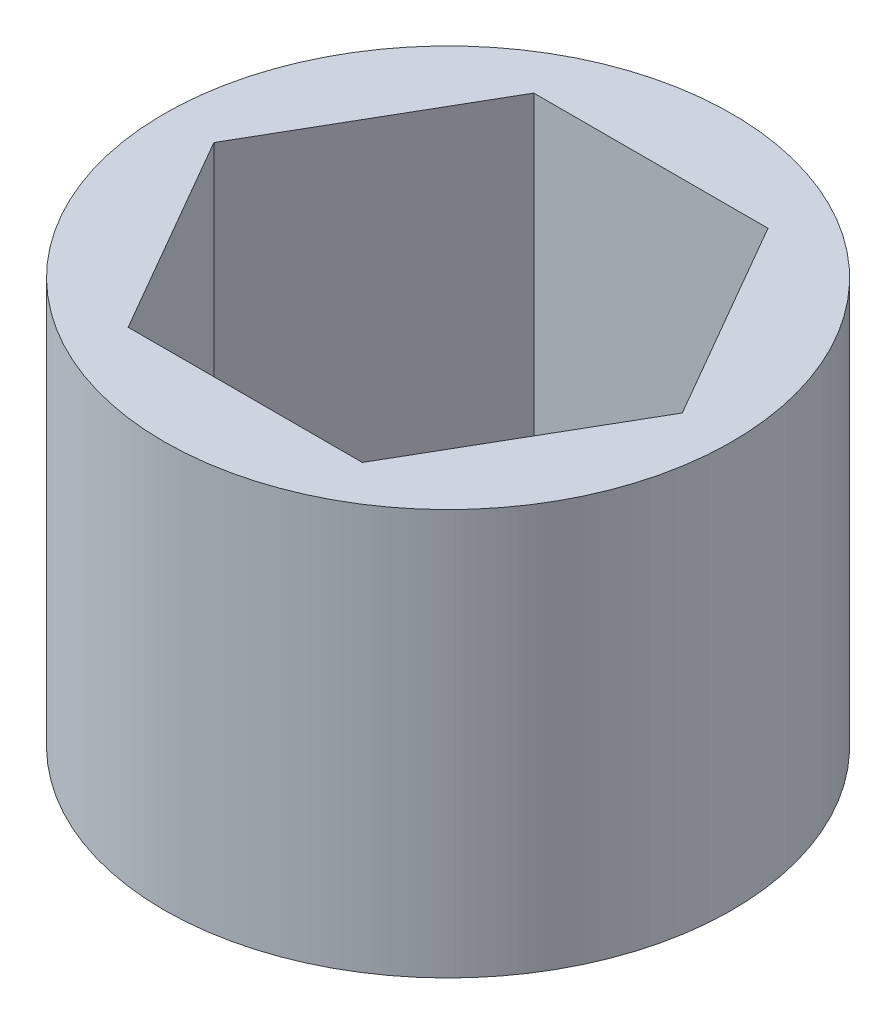
ISO-10303-21;
HEADER;
FILE_DESCRIPTION(('STEP AP214'),'2;1');
FILE_NAME('part.step','',(''),(''),'','','');
FILE_SCHEMA(('AUTOMOTIVE_DESIGN { 1 0 10303 214 1 1 1 1 }'));
ENDSEC;
DATA;
#1=APPLICATION_CONTEXT('core data for automotive mechanical design processes');
#2=APPLICATION_PROTOCOL_DEFINITION('international standard','automotive_design',2000,#1);
#3=PRODUCT_CONTEXT('',#1,'mechanical');
#4=PRODUCT('Part','Part','',(#3));
#5=PRODUCT_RELATED_PRODUCT_CATEGORY('part','',(#4));
#6=PRODUCT_DEFINITION_FORMATION('','',#4);
#7=PRODUCT_DEFINITION_CONTEXT('part definition',#1,'design');
#8=PRODUCT_DEFINITION('design','',#6,#7);
#9=PRODUCT_DEFINITION_SHAPE('','',#8);
#10=(LENGTH_UNIT() NAMED_UNIT(*) SI_UNIT(.MILLI.,.METRE.));
#11=(NAMED_UNIT(*) PLANE_ANGLE_UNIT() SI_UNIT($,.RADIAN.));
#12=(NAMED_UNIT(*) SI_UNIT($,.STERADIAN.) SOLID_ANGLE_UNIT());
#13=UNCERTAINTY_MEASURE_WITH_UNIT(LENGTH_MEASURE(1.E-05),#10,'distance_accuracy_value','');
#14=(GEOMETRIC_REPRESENTATION_CONTEXT(3) GLOBAL_UNCERTAINTY_ASSIGNED_CONTEXT((#13)) GLOBAL_UNIT_ASSIGNED_CONTEXT((#10,
#11,#12)) REPRESENTATION_CONTEXT('',''));
#15=CARTESIAN_POINT('',(0.,0.,0.));
#16=DIRECTION('',(0.,0.,1.));
#17=DIRECTION('',(1.,0.,0.));
#18=AXIS2_PLACEMENT_3D('',#15,#16,#17);
#19=CARTESIAN_POINT('',(0.,12.7,0.));
#20=DIRECTION('',(0.,1.,0.));
#21=DIRECTION('',(0.,0.,1.));
#22=AXIS2_PLACEMENT_3D('',#19,#20,#21);
#23=PLANE('',#22);
#24=CARTESIAN_POINT('',(0.,12.7,0.));
#25=DIRECTION('',(0.,1.,0.));
#26=DIRECTION('',(0.,0.,1.));
#27=AXIS2_PLACEMENT_3D('',#24,#25,#26);
#28=CIRCLE('',#27,8.89);
#29=CARTESIAN_POINT('',(0.,12.7,8.89));
#30=VERTEX_POINT('',#29);
#31=EDGE_CURVE('E11',#30,#30,#28,.T.);
#32=ORIENTED_EDGE('',*,*,#31,.T.);
#33=EDGE_LOOP('',(#32));
#34=FACE_BOUND('',#33,.T.);
#35=DIRECTION('',(-0.5,0.,-0.866025403784439));
#36=VECTOR('',#35,1.);
#37=CARTESIAN_POINT('',(7.33234841870825,12.7,0.));
#38=LINE('',#37,#36);
#39=CARTESIAN_POINT('',(7.33234841870825,12.7,0.));
#40=VERTEX_POINT('',#39);
#41=CARTESIAN_POINT('',(3.66617420935412,12.7,-6.35000000000001));
#42=VERTEX_POINT('',#41);
#43=EDGE_CURVE('E108',#40,#42,#38,.T.);
#44=ORIENTED_EDGE('',*,*,#43,.F.);
#45=DIRECTION('',(0.5,0.,-0.866025403784439));
#46=VECTOR('',#45,1.);
#47=CARTESIAN_POINT('',(3.66617420935413,12.7,6.35));
#48=LINE('',#47,#46);
#49=CARTESIAN_POINT('',(3.66617420935413,12.7,6.35));
#50=VERTEX_POINT('',#49);
#51=EDGE_CURVE('E99',#50,#40,#48,.T.);
#52=ORIENTED_EDGE('',*,*,#51,.F.);
#53=DIRECTION('',(1.,0.,0.));
#54=VECTOR('',#53,1.);
#55=CARTESIAN_POINT('',(-3.66617420935413,12.7,6.35));
#56=LINE('',#55,#54);
#57=CARTESIAN_POINT('',(-3.66617420935413,12.7,6.35));
#58=VERTEX_POINT('',#57);
#59=EDGE_CURVE('E133',#58,#50,#56,.T.);
#60=ORIENTED_EDGE('',*,*,#59,.F.);
#61=DIRECTION('',(0.5,0.,0.866025403784439));
#62=VECTOR('',#61,1.);
#63=CARTESIAN_POINT('',(-7.33234841870825,12.7,0.));
#64=LINE('',#63,#62);
#65=CARTESIAN_POINT('',(-7.33234841870825,12.7,0.));
#66=VERTEX_POINT('',#65);
#67=EDGE_CURVE('E130',#66,#58,#64,.T.);
#68=ORIENTED_EDGE('',*,*,#67,.F.);
#69=DIRECTION('',(-0.5,0.,0.866025403784439));
#70=VECTOR('',#69,1.);
#71=CARTESIAN_POINT('',(-3.66617420935413,12.7,-6.35000000000001));
#72=LINE('',#71,#70);
#73=CARTESIAN_POINT('',(-3.66617420935413,12.7,-6.35000000000001));
#74=VERTEX_POINT('',#73);
#75=EDGE_CURVE('E125',#74,#66,#72,.T.);
#76=ORIENTED_EDGE('',*,*,#75,.F.);
#77=DIRECTION('',(-1.,0.,0.));
#78=VECTOR('',#77,1.);
#79=CARTESIAN_POINT('',(3.66617420935412,12.7,-6.35000000000001));
#80=LINE('',#79,#78);
#81=EDGE_CURVE('E121',#42,#74,#80,.T.);
#82=ORIENTED_EDGE('',*,*,#81,.F.);
#83=EDGE_LOOP('',(#44,#52,#60,#68,#76,#82));
#84=FACE_BOUND('',#83,.T.);
#85=ADVANCED_FACE('F45',(#34,#84),#23,.T.);
#86=CARTESIAN_POINT('',(0.,0.,0.));
#87=DIRECTION('',(0.,1.,0.));
#88=DIRECTION('',(0.,0.,1.));
#89=AXIS2_PLACEMENT_3D('',#86,#87,#88);
#90=PLANE('',#89);
#91=CARTESIAN_POINT('',(0.,0.,0.));
#92=DIRECTION('',(0.,1.,0.));
#93=DIRECTION('',(0.,0.,1.));
#94=AXIS2_PLACEMENT_3D('',#91,#92,#93);
#95=CIRCLE('',#94,8.89);
#96=CARTESIAN_POINT('',(0.,0.,8.89));
#97=VERTEX_POINT('',#96);
#98=EDGE_CURVE('E49',#97,#97,#95,.T.);
#99=ORIENTED_EDGE('',*,*,#98,.F.);
#100=EDGE_LOOP('',(#99));
#101=FACE_BOUND('',#100,.T.);
#102=DIRECTION('',(0.5,0.,-0.866025403784439));
#103=VECTOR('',#102,1.);
#104=CARTESIAN_POINT('',(3.66617420935413,0.,6.35));
#105=LINE('',#104,#103);
#106=CARTESIAN_POINT('',(3.66617420935413,0.,6.35));
#107=VERTEX_POINT('',#106);
#108=CARTESIAN_POINT('',(7.33234841870825,0.,0.));
#109=VERTEX_POINT('',#108);
#110=EDGE_CURVE('E69',#107,#109,#105,.T.);
#111=ORIENTED_EDGE('',*,*,#110,.T.);
#112=DIRECTION('',(-0.5,0.,-0.866025403784439));
#113=VECTOR('',#112,1.);
#114=CARTESIAN_POINT('',(7.33234841870825,0.,0.));
#115=LINE('',#114,#113);
#116=CARTESIAN_POINT('',(3.66617420935412,0.,-6.35000000000001));
#117=VERTEX_POINT('',#116);
#118=EDGE_CURVE('E115',#109,#117,#115,.T.);
#119=ORIENTED_EDGE('',*,*,#118,.T.);
#120=DIRECTION('',(-1.,0.,0.));
#121=VECTOR('',#120,1.);
#122=CARTESIAN_POINT('',(3.66617420935412,0.,-6.35000000000001));
#123=LINE('',#122,#121);
#124=CARTESIAN_POINT('',(-3.66617420935413,0.,-6.35000000000001));
#125=VERTEX_POINT('',#124);
#126=EDGE_CURVE('E140',#117,#125,#123,.T.);
#127=ORIENTED_EDGE('',*,*,#126,.T.);
#128=DIRECTION('',(-0.5,0.,0.866025403784439));
#129=VECTOR('',#128,1.);
#130=CARTESIAN_POINT('',(-3.66617420935413,0.,-6.35000000000001));
#131=LINE('',#130,#129);
#132=CARTESIAN_POINT('',(-7.33234841870825,0.,0.));
#133=VERTEX_POINT('',#132);
#134=EDGE_CURVE('E144',#125,#133,#131,.T.);
#135=ORIENTED_EDGE('',*,*,#134,.T.);
#136=DIRECTION('',(0.5,0.,0.866025403784439));
#137=VECTOR('',#136,1.);
#138=CARTESIAN_POINT('',(-7.33234841870825,0.,0.));
#139=LINE('',#138,#137);
#140=CARTESIAN_POINT('',(-3.66617420935413,0.,6.35));
#141=VERTEX_POINT('',#140);
#142=EDGE_CURVE('E148',#133,#141,#139,.T.);
#143=ORIENTED_EDGE('',*,*,#142,.T.);
#144=DIRECTION('',(1.,0.,0.));
#145=VECTOR('',#144,1.);
#146=CARTESIAN_POINT('',(-3.66617420935413,0.,6.35));
#147=LINE('',#146,#145);
#148=EDGE_CURVE('E109',#141,#107,#147,.T.);
#149=ORIENTED_EDGE('',*,*,#148,.T.);
#150=EDGE_LOOP('',(#111,#119,#127,#135,#143,#149));
#151=FACE_BOUND('',#150,.T.);
#152=ADVANCED_FACE('F172',(#101,#151),#90,.F.);
#153=CARTESIAN_POINT('',(0.,12.7,0.));
#154=DIRECTION('',(0.,-1.,0.));
#155=DIRECTION('',(0.,0.,-1.));
#156=AXIS2_PLACEMENT_3D('',#153,#154,#155);
#157=CYLINDRICAL_SURFACE('',#156,8.89);
#158=ORIENTED_EDGE('',*,*,#31,.F.);
#159=EDGE_LOOP('',(#158));
#160=FACE_BOUND('',#159,.T.);
#161=ORIENTED_EDGE('',*,*,#98,.T.);
#162=EDGE_LOOP('',(#161));
#163=FACE_BOUND('',#162,.T.);
#164=ADVANCED_FACE('F47',(#160,#163),#157,.T.);
#165=CARTESIAN_POINT('',(3.66617420935413,12.7,6.35));
#166=DIRECTION('',(-0.866025403784439,0.,-0.5));
#167=DIRECTION('',(-0.5,0.,0.866025403784439));
#168=AXIS2_PLACEMENT_3D('',#165,#166,#167);
#169=PLANE('',#168);
#170=ORIENTED_EDGE('',*,*,#110,.F.);
#171=DIRECTION('',(0.,-1.,0.));
#172=VECTOR('',#171,1.);
#173=CARTESIAN_POINT('',(3.66617420935413,12.7,6.35));
#174=LINE('',#173,#172);
#175=EDGE_CURVE('E103',#50,#107,#174,.T.);
#176=ORIENTED_EDGE('',*,*,#175,.F.);
#177=ORIENTED_EDGE('',*,*,#51,.T.);
#178=DIRECTION('',(0.,-1.,0.));
#179=VECTOR('',#178,1.);
#180=CARTESIAN_POINT('',(7.33234841870825,12.7,0.));
#181=LINE('',#180,#179);
#182=EDGE_CURVE('E102',#40,#109,#181,.T.);
#183=ORIENTED_EDGE('',*,*,#182,.T.);
#184=EDGE_LOOP('',(#170,#176,#177,#183));
#185=FACE_BOUND('',#184,.T.);
#186=ADVANCED_FACE('F101',(#185),#169,.T.);
#187=CARTESIAN_POINT('',(7.33234841870825,12.7,0.));
#188=DIRECTION('',(-0.866025403784439,0.,0.5));
#189=DIRECTION('',(0.5,0.,0.866025403784439));
#190=AXIS2_PLACEMENT_3D('',#187,#188,#189);
#191=PLANE('',#190);
#192=ORIENTED_EDGE('',*,*,#118,.F.);
#193=ORIENTED_EDGE('',*,*,#182,.F.);
#194=ORIENTED_EDGE('',*,*,#43,.T.);
#195=DIRECTION('',(0.,-1.,0.));
#196=VECTOR('',#195,1.);
#197=CARTESIAN_POINT('',(3.66617420935412,12.7,-6.35000000000001));
#198=LINE('',#197,#196);
#199=EDGE_CURVE('E117',#42,#117,#198,.T.);
#200=ORIENTED_EDGE('',*,*,#199,.T.);
#201=EDGE_LOOP('',(#192,#193,#194,#200));
#202=FACE_BOUND('',#201,.T.);
#203=ADVANCED_FACE('F112',(#202),#191,.T.);
#204=CARTESIAN_POINT('',(3.66617420935412,12.7,-6.35000000000001));
#205=DIRECTION('',(0.,0.,1.));
#206=DIRECTION('',(1.,0.,0.));
#207=AXIS2_PLACEMENT_3D('',#204,#205,#206);
#208=PLANE('',#207);
#209=ORIENTED_EDGE('',*,*,#126,.F.);
#210=ORIENTED_EDGE('',*,*,#199,.F.);
#211=ORIENTED_EDGE('',*,*,#81,.T.);
#212=DIRECTION('',(0.,-1.,0.));
#213=VECTOR('',#212,1.);
#214=CARTESIAN_POINT('',(-3.66617420935413,12.7,-6.35000000000001));
#215=LINE('',#214,#213);
#216=EDGE_CURVE('E162',#74,#125,#215,.T.);
#217=ORIENTED_EDGE('',*,*,#216,.T.);
#218=EDGE_LOOP('',(#209,#210,#211,#217));
#219=FACE_BOUND('',#218,.T.);
#220=ADVANCED_FACE('F168',(#219),#208,.T.);
#221=CARTESIAN_POINT('',(-3.66617420935413,12.7,-6.35000000000001));
#222=DIRECTION('',(0.866025403784439,0.,0.5));
#223=DIRECTION('',(0.5,0.,-0.866025403784439));
#224=AXIS2_PLACEMENT_3D('',#221,#222,#223);
#225=PLANE('',#224);
#226=ORIENTED_EDGE('',*,*,#134,.F.);
#227=ORIENTED_EDGE('',*,*,#216,.F.);
#228=ORIENTED_EDGE('',*,*,#75,.T.);
#229=DIRECTION('',(0.,-1.,0.));
#230=VECTOR('',#229,1.);
#231=CARTESIAN_POINT('',(-7.33234841870825,12.7,0.));
#232=LINE('',#231,#230);
#233=EDGE_CURVE('E159',#66,#133,#232,.T.);
#234=ORIENTED_EDGE('',*,*,#233,.T.);
#235=EDGE_LOOP('',(#226,#227,#228,#234));
#236=FACE_BOUND('',#235,.T.);
#237=ADVANCED_FACE('F180',(#236),#225,.T.);
#238=CARTESIAN_POINT('',(-7.33234841870825,12.7,0.));
#239=DIRECTION('',(0.866025403784439,0.,-0.5));
#240=DIRECTION('',(-0.5,0.,-0.866025403784439));
#241=AXIS2_PLACEMENT_3D('',#238,#239,#240);
#242=PLANE('',#241);
#243=ORIENTED_EDGE('',*,*,#142,.F.);
#244=ORIENTED_EDGE('',*,*,#233,.F.);
#245=ORIENTED_EDGE('',*,*,#67,.T.);
#246=DIRECTION('',(0.,-1.,0.));
#247=VECTOR('',#246,1.);
#248=CARTESIAN_POINT('',(-3.66617420935413,12.7,6.35));
#249=LINE('',#248,#247);
#250=EDGE_CURVE('E61',#58,#141,#249,.T.);
#251=ORIENTED_EDGE('',*,*,#250,.T.);
#252=EDGE_LOOP('',(#243,#244,#245,#251));
#253=FACE_BOUND('',#252,.T.);
#254=ADVANCED_FACE('F178',(#253),#242,.T.);
#255=CARTESIAN_POINT('',(-3.66617420935413,12.7,6.35));
#256=DIRECTION('',(0.,0.,-1.));
#257=DIRECTION('',(-1.,0.,0.));
#258=AXIS2_PLACEMENT_3D('',#255,#256,#257);
#259=PLANE('',#258);
#260=ORIENTED_EDGE('',*,*,#148,.F.);
#261=ORIENTED_EDGE('',*,*,#250,.F.);
#262=ORIENTED_EDGE('',*,*,#59,.T.);
#263=ORIENTED_EDGE('',*,*,#175,.T.);
#264=EDGE_LOOP('',(#260,#261,#262,#263));
#265=FACE_BOUND('',#264,.T.);
#266=ADVANCED_FACE('F174',(#265),#259,.T.);
#267=CLOSED_SHELL('',(#85,#152,#164,#186,#203,#220,#237,#254,#266));
#268=MANIFOLD_SOLID_BREP('B2',#267);
#269=ADVANCED_BREP_SHAPE_REPRESENTATION('',(#18,#268),#14);
#270=SHAPE_DEFINITION_REPRESENTATION(#9,#269);
ENDSEC;
END-ISO-10303-21;
